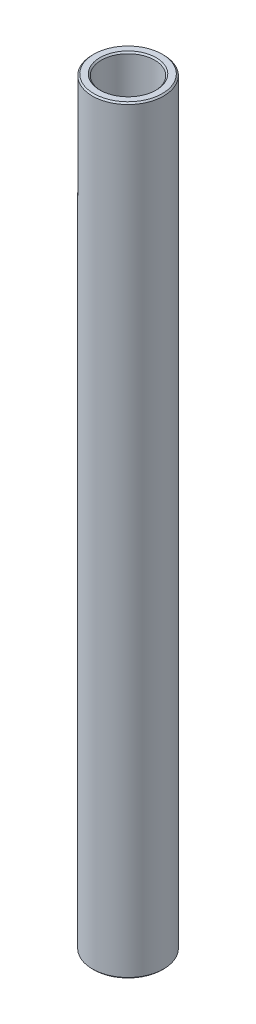
ISO-10303-21;
HEADER;
FILE_DESCRIPTION(('STEP AP214'),'2;1');
FILE_NAME('part.step','',(''),(''),'','','');
FILE_SCHEMA(('AUTOMOTIVE_DESIGN { 1 0 10303 214 1 1 1 1 }'));
ENDSEC;
DATA;
#1=APPLICATION_CONTEXT('core data for automotive mechanical design processes');
#2=APPLICATION_PROTOCOL_DEFINITION('international standard','automotive_design',2000,#1);
#3=PRODUCT_CONTEXT('',#1,'mechanical');
#4=PRODUCT('Part','Part','',(#3));
#5=PRODUCT_RELATED_PRODUCT_CATEGORY('part','',(#4));
#6=PRODUCT_DEFINITION_FORMATION('','',#4);
#7=PRODUCT_DEFINITION_CONTEXT('part definition',#1,'design');
#8=PRODUCT_DEFINITION('design','',#6,#7);
#9=PRODUCT_DEFINITION_SHAPE('','',#8);
#10=(LENGTH_UNIT() NAMED_UNIT(*) SI_UNIT(.MILLI.,.METRE.));
#11=(NAMED_UNIT(*) PLANE_ANGLE_UNIT() SI_UNIT($,.RADIAN.));
#12=(NAMED_UNIT(*) SI_UNIT($,.STERADIAN.) SOLID_ANGLE_UNIT());
#13=UNCERTAINTY_MEASURE_WITH_UNIT(LENGTH_MEASURE(1.E-05),#10,'distance_accuracy_value','');
#14=(GEOMETRIC_REPRESENTATION_CONTEXT(3) GLOBAL_UNCERTAINTY_ASSIGNED_CONTEXT((#13)) GLOBAL_UNIT_ASSIGNED_CONTEXT((#10,
#11,#12)) REPRESENTATION_CONTEXT('',''));
#15=CARTESIAN_POINT('',(0.,0.,0.));
#16=DIRECTION('',(0.,0.,1.));
#17=DIRECTION('',(1.,0.,0.));
#18=AXIS2_PLACEMENT_3D('',#15,#16,#17);
#19=CARTESIAN_POINT('',(6.35000000000029,70.6436949648126,0.));
#20=DIRECTION('',(-1.93068195234275E-12,-1.,0.));
#21=DIRECTION('',(1.,-1.93068195234275E-12,0.));
#22=AXIS2_PLACEMENT_3D('',#19,#20,#21);
#23=PLANE('',#22);
#24=CARTESIAN_POINT('',(1.83897455960854E-11,70.6436949648249,0.));
#25=DIRECTION('',(-1.93068195234275E-12,-1.,0.));
#26=DIRECTION('',(1.,-1.93068195234275E-12,0.));
#27=AXIS2_PLACEMENT_3D('',#24,#25,#26);
#28=CIRCLE('',#27,5.01649999998007);
#29=CARTESIAN_POINT('',(5.01649999999846,70.6436949648152,0.));
#30=VERTEX_POINT('',#29);
#31=EDGE_CURVE('E10',#30,#30,#28,.F.);
#32=ORIENTED_EDGE('',*,*,#31,.T.);
#33=EDGE_LOOP('',(#32));
#34=FACE_BOUND('',#33,.T.);
#35=CARTESIAN_POINT('',(1.83897455960855E-11,70.6436949648249,0.));
#36=DIRECTION('',(-1.93068195234275E-12,-1.,0.));
#37=DIRECTION('',(1.,-1.93068195234275E-12,0.));
#38=AXIS2_PLACEMENT_3D('',#35,#36,#37);
#39=CIRCLE('',#38,6.09599999998038);
#40=CARTESIAN_POINT('',(6.09599999999877,70.6436949648131,0.));
#41=VERTEX_POINT('',#40);
#42=EDGE_CURVE('E37',#41,#41,#39,.T.);
#43=ORIENTED_EDGE('',*,*,#42,.T.);
#44=EDGE_LOOP('',(#43));
#45=FACE_BOUND('',#44,.T.);
#46=ADVANCED_FACE('F30',(#34,#45),#23,.T.);
#47=CARTESIAN_POINT('',(0.,61.1186949648142,0.));
#48=DIRECTION('',(-1.93068195234275E-12,-1.,0.));
#49=DIRECTION('',(1.,-1.93068195234275E-12,0.));
#50=AXIS2_PLACEMENT_3D('',#47,#48,#49);
#51=CYLINDRICAL_SURFACE('',#50,4.76249999985098);
#52=CARTESIAN_POINT('',(2.79186987724549E-10,205.724069964966,0.));
#53=DIRECTION('',(1.93068195234273E-12,1.,0.));
#54=DIRECTION('',(-1.,1.93068195234273E-12,0.));
#55=AXIS2_PLACEMENT_3D('',#52,#53,#54);
#56=CIRCLE('',#55,4.76249999985098);
#57=CARTESIAN_POINT('',(-4.76249999957179,205.724069964975,0.));
#58=VERTEX_POINT('',#57);
#59=EDGE_CURVE('E41',#58,#58,#56,.T.);
#60=ORIENTED_EDGE('',*,*,#59,.T.);
#61=EDGE_LOOP('',(#60));
#62=FACE_BOUND('',#61,.T.);
#63=CARTESIAN_POINT('',(1.88801388122297E-11,70.897694964954,0.));
#64=DIRECTION('',(-1.93068195234275E-12,-1.,0.));
#65=DIRECTION('',(1.,-1.93068195234275E-12,0.));
#66=AXIS2_PLACEMENT_3D('',#63,#64,#65);
#67=CIRCLE('',#66,4.76249999985098);
#68=CARTESIAN_POINT('',(4.76249999986986,70.8976949649448,0.));
#69=VERTEX_POINT('',#68);
#70=EDGE_CURVE('E45',#69,#69,#67,.T.);
#71=ORIENTED_EDGE('',*,*,#70,.T.);
#72=EDGE_LOOP('',(#71));
#73=FACE_BOUND('',#72,.T.);
#74=ADVANCED_FACE('F74',(#62,#73),#51,.F.);
#75=CARTESIAN_POINT('',(4.76250000000001,205.978069964828,0.));
#76=DIRECTION('',(1.93068195234275E-12,1.,0.));
#77=DIRECTION('',(-1.,1.93068195234275E-12,0.));
#78=AXIS2_PLACEMENT_3D('',#75,#76,#77);
#79=PLANE('',#78);
#80=CARTESIAN_POINT('',(2.79677380940195E-10,205.978069964837,0.));
#81=DIRECTION('',(1.93068195234275E-12,1.,0.));
#82=DIRECTION('',(-1.,1.93068195234275E-12,0.));
#83=AXIS2_PLACEMENT_3D('',#80,#81,#82);
#84=CIRCLE('',#83,6.09599999972208);
#85=CARTESIAN_POINT('',(-6.0959999994424,205.978069964849,0.));
#86=VERTEX_POINT('',#85);
#87=EDGE_CURVE('E50',#86,#86,#84,.T.);
#88=ORIENTED_EDGE('',*,*,#87,.T.);
#89=EDGE_LOOP('',(#88));
#90=FACE_BOUND('',#89,.T.);
#91=CARTESIAN_POINT('',(2.79677380940195E-10,205.978069964837,0.));
#92=DIRECTION('',(1.93068195234275E-12,1.,0.));
#93=DIRECTION('',(-1.,1.93068195234275E-12,0.));
#94=AXIS2_PLACEMENT_3D('',#91,#92,#93);
#95=CIRCLE('',#94,5.01649999972184);
#96=CARTESIAN_POINT('',(-5.01649999944216,205.978069964847,0.));
#97=VERTEX_POINT('',#96);
#98=EDGE_CURVE('E53',#97,#97,#95,.F.);
#99=ORIENTED_EDGE('',*,*,#98,.T.);
#100=EDGE_LOOP('',(#99));
#101=FACE_BOUND('',#100,.T.);
#102=ADVANCED_FACE('F79',(#90,#101),#79,.T.);
#103=CARTESIAN_POINT('',(0.,61.1186949648142,0.));
#104=DIRECTION('',(-1.93068195234275E-12,-1.,0.));
#105=DIRECTION('',(1.,-1.93068195234275E-12,0.));
#106=AXIS2_PLACEMENT_3D('',#103,#104,#105);
#107=CYLINDRICAL_SURFACE('',#106,6.34999999985125);
#108=CARTESIAN_POINT('',(2.79186987724051E-10,205.724069964708,0.));
#109=DIRECTION('',(1.93068195234267E-12,1.,0.));
#110=DIRECTION('',(-1.,1.93068195234267E-12,0.));
#111=AXIS2_PLACEMENT_3D('',#108,#109,#110);
#112=CIRCLE('',#111,6.34999999985125);
#113=CARTESIAN_POINT('',(-6.34999999957207,205.72406996472,0.));
#114=VERTEX_POINT('',#113);
#115=EDGE_CURVE('E56',#114,#114,#112,.F.);
#116=ORIENTED_EDGE('',*,*,#115,.T.);
#117=EDGE_LOOP('',(#116));
#118=FACE_BOUND('',#117,.T.);
#119=CARTESIAN_POINT('',(1.88801388117312E-11,70.8976949646957,0.));
#120=DIRECTION('',(-1.93068195234275E-12,-1.,0.));
#121=DIRECTION('',(1.,-1.93068195234275E-12,0.));
#122=AXIS2_PLACEMENT_3D('',#119,#120,#121);
#123=CIRCLE('',#122,6.34999999985125);
#124=CARTESIAN_POINT('',(6.34999999987013,70.8976949646835,0.));
#125=VERTEX_POINT('',#124);
#126=EDGE_CURVE('E59',#125,#125,#123,.F.);
#127=ORIENTED_EDGE('',*,*,#126,.T.);
#128=EDGE_LOOP('',(#127));
#129=FACE_BOUND('',#128,.T.);
#130=ADVANCED_FACE('F63',(#118,#129),#107,.T.);
#131=CARTESIAN_POINT('',(2.79186987724051E-10,205.724069964708,0.));
#132=DIRECTION('',(-1.93068195234267E-12,-1.,0.));
#133=DIRECTION('',(1.,-1.93068195234267E-12,0.));
#134=AXIS2_PLACEMENT_3D('',#131,#132,#133);
#135=CONICAL_SURFACE('',#134,6.34999999985125,0.785398163397534);
#136=ORIENTED_EDGE('',*,*,#87,.F.);
#137=EDGE_LOOP('',(#136));
#138=FACE_BOUND('',#137,.T.);
#139=ORIENTED_EDGE('',*,*,#115,.F.);
#140=EDGE_LOOP('',(#139));
#141=FACE_BOUND('',#140,.T.);
#142=ADVANCED_FACE('F84',(#138,#141),#135,.T.);
#143=CARTESIAN_POINT('',(2.79677380940195E-10,205.978069964837,0.));
#144=DIRECTION('',(1.93068195234273E-12,1.,0.));
#145=DIRECTION('',(-1.,1.93068195234273E-12,0.));
#146=AXIS2_PLACEMENT_3D('',#143,#144,#145);
#147=CONICAL_SURFACE('',#146,5.01649999972183,0.785398163397375);
#148=ORIENTED_EDGE('',*,*,#59,.F.);
#149=EDGE_LOOP('',(#148));
#150=FACE_BOUND('',#149,.T.);
#151=ORIENTED_EDGE('',*,*,#98,.F.);
#152=EDGE_LOOP('',(#151));
#153=FACE_BOUND('',#152,.T.);
#154=ADVANCED_FACE('F71',(#150,#153),#147,.F.);
#155=CARTESIAN_POINT('',(1.88801388122298E-11,70.897694964954,0.));
#156=DIRECTION('',(-1.93068195234275E-12,-1.,0.));
#157=DIRECTION('',(1.,-1.93068195234275E-12,0.));
#158=AXIS2_PLACEMENT_3D('',#155,#156,#157);
#159=CONICAL_SURFACE('',#158,4.76249999985098,0.785398163397431);
#160=ORIENTED_EDGE('',*,*,#31,.F.);
#161=EDGE_LOOP('',(#160));
#162=FACE_BOUND('',#161,.T.);
#163=ORIENTED_EDGE('',*,*,#70,.F.);
#164=EDGE_LOOP('',(#163));
#165=FACE_BOUND('',#164,.T.);
#166=ADVANCED_FACE('F67',(#162,#165),#159,.F.);
#167=CARTESIAN_POINT('',(1.83897455960854E-11,70.6436949648249,0.));
#168=DIRECTION('',(1.93068195234275E-12,1.,0.));
#169=DIRECTION('',(-1.,1.93068195234275E-12,0.));
#170=AXIS2_PLACEMENT_3D('',#167,#168,#169);
#171=CONICAL_SURFACE('',#170,6.09599999998038,0.785398163397479);
#172=ORIENTED_EDGE('',*,*,#126,.F.);
#173=EDGE_LOOP('',(#172));
#174=FACE_BOUND('',#173,.T.);
#175=ORIENTED_EDGE('',*,*,#42,.F.);
#176=EDGE_LOOP('',(#175));
#177=FACE_BOUND('',#176,.T.);
#178=ADVANCED_FACE('F32',(#174,#177),#171,.T.);
#179=CLOSED_SHELL('',(#46,#74,#102,#130,#142,#154,#166,#178));
#180=MANIFOLD_SOLID_BREP('B2',#179);
#181=ADVANCED_BREP_SHAPE_REPRESENTATION('',(#18,#180),#14);
#182=SHAPE_DEFINITION_REPRESENTATION(#9,#181);
ENDSEC;
END-ISO-10303-21;
